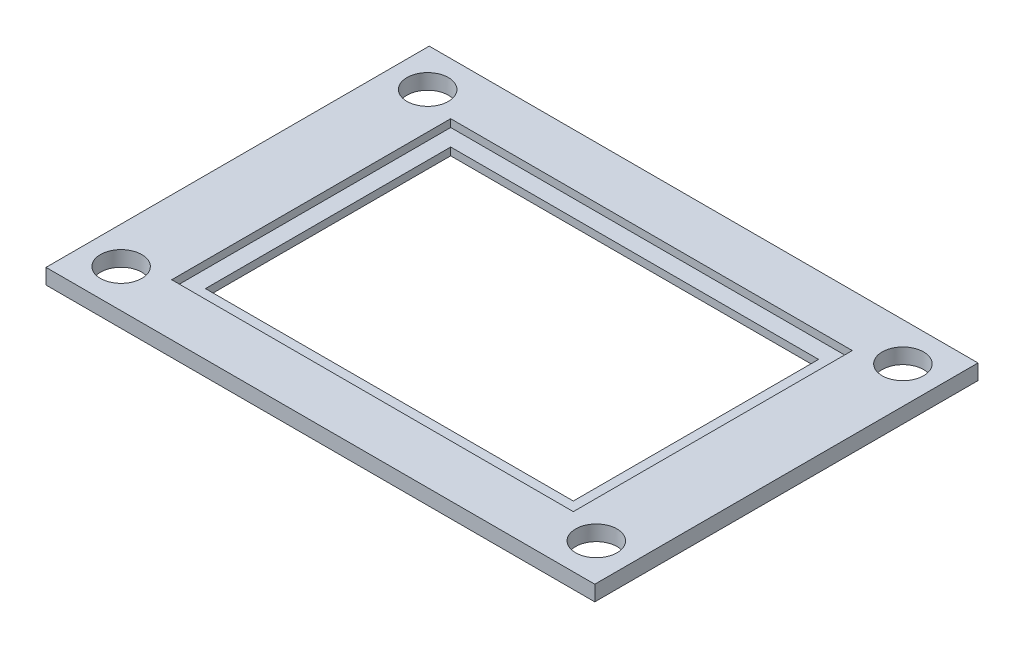
ISO-10303-21;
HEADER;
FILE_DESCRIPTION(('STEP AP214'),'2;1');
FILE_NAME('part.step','',(''),(''),'','','');
FILE_SCHEMA(('AUTOMOTIVE_DESIGN { 1 0 10303 214 1 1 1 1 }'));
ENDSEC;
DATA;
#1=APPLICATION_CONTEXT('core data for automotive mechanical design processes');
#2=APPLICATION_PROTOCOL_DEFINITION('international standard','automotive_design',2000,#1);
#3=PRODUCT_CONTEXT('',#1,'mechanical');
#4=PRODUCT('Part','Part','',(#3));
#5=PRODUCT_RELATED_PRODUCT_CATEGORY('part','',(#4));
#6=PRODUCT_DEFINITION_FORMATION('','',#4);
#7=PRODUCT_DEFINITION_CONTEXT('part definition',#1,'design');
#8=PRODUCT_DEFINITION('design','',#6,#7);
#9=PRODUCT_DEFINITION_SHAPE('','',#8);
#10=(LENGTH_UNIT() NAMED_UNIT(*) SI_UNIT(.MILLI.,.METRE.));
#11=(NAMED_UNIT(*) PLANE_ANGLE_UNIT() SI_UNIT($,.RADIAN.));
#12=(NAMED_UNIT(*) SI_UNIT($,.STERADIAN.) SOLID_ANGLE_UNIT());
#13=UNCERTAINTY_MEASURE_WITH_UNIT(LENGTH_MEASURE(1.E-05),#10,'distance_accuracy_value','');
#14=(GEOMETRIC_REPRESENTATION_CONTEXT(3) GLOBAL_UNCERTAINTY_ASSIGNED_CONTEXT((#13)) GLOBAL_UNIT_ASSIGNED_CONTEXT((#10,
#11,#12)) REPRESENTATION_CONTEXT('',''));
#15=CARTESIAN_POINT('',(0.,0.,0.));
#16=DIRECTION('',(0.,0.,1.));
#17=DIRECTION('',(1.,0.,0.));
#18=AXIS2_PLACEMENT_3D('',#15,#16,#17);
#19=CARTESIAN_POINT('',(0.,1.,0.));
#20=DIRECTION('',(0.,-1.,0.));
#21=DIRECTION('',(0.,0.,-1.));
#22=AXIS2_PLACEMENT_3D('',#19,#20,#21);
#23=PLANE('',#22);
#24=CARTESIAN_POINT('',(15.5,1.,-10.));
#25=DIRECTION('',(0.,1.,0.));
#26=DIRECTION('',(0.,0.,1.));
#27=AXIS2_PLACEMENT_3D('',#24,#25,#26);
#28=CIRCLE('',#27,1.35);
#29=CARTESIAN_POINT('',(15.5,1.,-8.65));
#30=VERTEX_POINT('',#29);
#31=EDGE_CURVE('E469',#30,#30,#28,.T.);
#32=ORIENTED_EDGE('',*,*,#31,.F.);
#33=EDGE_LOOP('',(#32));
#34=FACE_BOUND('',#33,.T.);
#35=CARTESIAN_POINT('',(15.5,1.,10.));
#36=DIRECTION('',(0.,1.,0.));
#37=DIRECTION('',(0.,0.,1.));
#38=AXIS2_PLACEMENT_3D('',#35,#36,#37);
#39=CIRCLE('',#38,1.35);
#40=CARTESIAN_POINT('',(15.5,1.,11.35));
#41=VERTEX_POINT('',#40);
#42=EDGE_CURVE('E476',#41,#41,#39,.T.);
#43=ORIENTED_EDGE('',*,*,#42,.F.);
#44=EDGE_LOOP('',(#43));
#45=FACE_BOUND('',#44,.T.);
#46=CARTESIAN_POINT('',(-15.5,1.,10.));
#47=DIRECTION('',(0.,1.,0.));
#48=DIRECTION('',(0.,0.,1.));
#49=AXIS2_PLACEMENT_3D('',#46,#47,#48);
#50=CIRCLE('',#49,1.35);
#51=CARTESIAN_POINT('',(-15.5,1.,11.35));
#52=VERTEX_POINT('',#51);
#53=EDGE_CURVE('E486',#52,#52,#50,.T.);
#54=ORIENTED_EDGE('',*,*,#53,.F.);
#55=EDGE_LOOP('',(#54));
#56=FACE_BOUND('',#55,.T.);
#57=CARTESIAN_POINT('',(-15.5,1.,-10.));
#58=DIRECTION('',(0.,1.,0.));
#59=DIRECTION('',(0.,0.,1.));
#60=AXIS2_PLACEMENT_3D('',#57,#58,#59);
#61=CIRCLE('',#60,1.35);
#62=CARTESIAN_POINT('',(-15.5,1.,-8.65));
#63=VERTEX_POINT('',#62);
#64=EDGE_CURVE('E167',#63,#63,#61,.T.);
#65=ORIENTED_EDGE('',*,*,#64,.F.);
#66=EDGE_LOOP('',(#65));
#67=FACE_BOUND('',#66,.T.);
#68=DIRECTION('',(-1.,0.,0.));
#69=VECTOR('',#68,1.);
#70=CARTESIAN_POINT('',(-13.1,1.,-9.1));
#71=LINE('',#70,#69);
#72=CARTESIAN_POINT('',(13.1,1.,-9.1));
#73=VERTEX_POINT('',#72);
#74=CARTESIAN_POINT('',(-13.1,1.,-9.1));
#75=VERTEX_POINT('',#74);
#76=EDGE_CURVE('E166',#73,#75,#71,.T.);
#77=ORIENTED_EDGE('',*,*,#76,.F.);
#78=DIRECTION('',(0.,0.,-1.));
#79=VECTOR('',#78,1.);
#80=CARTESIAN_POINT('',(13.1,1.,9.1));
#81=LINE('',#80,#79);
#82=CARTESIAN_POINT('',(13.1,1.,9.1));
#83=VERTEX_POINT('',#82);
#84=EDGE_CURVE('E54',#83,#73,#81,.T.);
#85=ORIENTED_EDGE('',*,*,#84,.F.);
#86=DIRECTION('',(1.,0.,0.));
#87=VECTOR('',#86,1.);
#88=CARTESIAN_POINT('',(-13.1,1.,9.1));
#89=LINE('',#88,#87);
#90=CARTESIAN_POINT('',(-13.1,1.,9.1));
#91=VERTEX_POINT('',#90);
#92=EDGE_CURVE('E150',#91,#83,#89,.T.);
#93=ORIENTED_EDGE('',*,*,#92,.F.);
#94=DIRECTION('',(0.,0.,1.));
#95=VECTOR('',#94,1.);
#96=CARTESIAN_POINT('',(-13.1,1.,9.1));
#97=LINE('',#96,#95);
#98=EDGE_CURVE('E154',#75,#91,#97,.T.);
#99=ORIENTED_EDGE('',*,*,#98,.F.);
#100=EDGE_LOOP('',(#77,#85,#93,#99));
#101=FACE_BOUND('',#100,.T.);
#102=DIRECTION('',(0.,0.,-1.));
#103=VECTOR('',#102,1.);
#104=CARTESIAN_POINT('',(17.9,1.,12.5));
#105=LINE('',#104,#103);
#106=CARTESIAN_POINT('',(17.9,1.,12.5));
#107=VERTEX_POINT('',#106);
#108=CARTESIAN_POINT('',(17.9,1.,-12.5));
#109=VERTEX_POINT('',#108);
#110=EDGE_CURVE('E218',#107,#109,#105,.T.);
#111=ORIENTED_EDGE('',*,*,#110,.T.);
#112=DIRECTION('',(-1.,0.,0.));
#113=VECTOR('',#112,1.);
#114=CARTESIAN_POINT('',(-17.9,1.,-12.5));
#115=LINE('',#114,#113);
#116=CARTESIAN_POINT('',(-17.9,1.,-12.5));
#117=VERTEX_POINT('',#116);
#118=EDGE_CURVE('E222',#109,#117,#115,.T.);
#119=ORIENTED_EDGE('',*,*,#118,.T.);
#120=DIRECTION('',(0.,0.,1.));
#121=VECTOR('',#120,1.);
#122=CARTESIAN_POINT('',(-17.9,1.,12.5));
#123=LINE('',#122,#121);
#124=CARTESIAN_POINT('',(-17.9,1.,12.5));
#125=VERTEX_POINT('',#124);
#126=EDGE_CURVE('E226',#117,#125,#123,.T.);
#127=ORIENTED_EDGE('',*,*,#126,.T.);
#128=DIRECTION('',(1.,0.,0.));
#129=VECTOR('',#128,1.);
#130=CARTESIAN_POINT('',(-17.9,1.,12.5));
#131=LINE('',#130,#129);
#132=EDGE_CURVE('E229',#125,#107,#131,.T.);
#133=ORIENTED_EDGE('',*,*,#132,.T.);
#134=EDGE_LOOP('',(#111,#119,#127,#133));
#135=FACE_BOUND('',#134,.T.);
#136=ADVANCED_FACE('F38',(#34,#45,#56,#67,#101,#135),#23,.F.);
#137=CARTESIAN_POINT('',(0.,0.,0.));
#138=DIRECTION('',(0.,-1.,0.));
#139=DIRECTION('',(0.,0.,-1.));
#140=AXIS2_PLACEMENT_3D('',#137,#138,#139);
#141=PLANE('',#140);
#142=CARTESIAN_POINT('',(15.5,0.,-10.));
#143=DIRECTION('',(0.,-1.,0.));
#144=DIRECTION('',(0.,0.,-1.));
#145=AXIS2_PLACEMENT_3D('',#142,#143,#144);
#146=CIRCLE('',#145,1.35);
#147=CARTESIAN_POINT('',(15.5,0.,-11.35));
#148=VERTEX_POINT('',#147);
#149=EDGE_CURVE('E467',#148,#148,#146,.F.);
#150=ORIENTED_EDGE('',*,*,#149,.T.);
#151=EDGE_LOOP('',(#150));
#152=FACE_BOUND('',#151,.T.);
#153=CARTESIAN_POINT('',(15.5,0.,10.));
#154=DIRECTION('',(0.,-1.,0.));
#155=DIRECTION('',(0.,0.,-1.));
#156=AXIS2_PLACEMENT_3D('',#153,#154,#155);
#157=CIRCLE('',#156,1.35);
#158=CARTESIAN_POINT('',(15.5,0.,8.65));
#159=VERTEX_POINT('',#158);
#160=EDGE_CURVE('E471',#159,#159,#157,.F.);
#161=ORIENTED_EDGE('',*,*,#160,.T.);
#162=EDGE_LOOP('',(#161));
#163=FACE_BOUND('',#162,.T.);
#164=CARTESIAN_POINT('',(-15.5,0.,10.));
#165=DIRECTION('',(0.,-1.,0.));
#166=DIRECTION('',(0.,0.,-1.));
#167=AXIS2_PLACEMENT_3D('',#164,#165,#166);
#168=CIRCLE('',#167,1.35);
#169=CARTESIAN_POINT('',(-15.5,0.,8.65));
#170=VERTEX_POINT('',#169);
#171=EDGE_CURVE('E491',#170,#170,#168,.F.);
#172=ORIENTED_EDGE('',*,*,#171,.T.);
#173=EDGE_LOOP('',(#172));
#174=FACE_BOUND('',#173,.T.);
#175=CARTESIAN_POINT('',(-15.5,0.,-10.));
#176=DIRECTION('',(0.,-1.,0.));
#177=DIRECTION('',(0.,0.,-1.));
#178=AXIS2_PLACEMENT_3D('',#175,#176,#177);
#179=CIRCLE('',#178,1.35);
#180=CARTESIAN_POINT('',(-15.5,0.,-11.35));
#181=VERTEX_POINT('',#180);
#182=EDGE_CURVE('E157',#181,#181,#179,.F.);
#183=ORIENTED_EDGE('',*,*,#182,.T.);
#184=EDGE_LOOP('',(#183));
#185=FACE_BOUND('',#184,.T.);
#186=DIRECTION('',(0.,0.,-1.));
#187=VECTOR('',#186,1.);
#188=CARTESIAN_POINT('',(17.9,0.,12.5));
#189=LINE('',#188,#187);
#190=CARTESIAN_POINT('',(17.9,0.,12.5));
#191=VERTEX_POINT('',#190);
#192=CARTESIAN_POINT('',(17.9,0.,-12.5));
#193=VERTEX_POINT('',#192);
#194=EDGE_CURVE('E217',#191,#193,#189,.T.);
#195=ORIENTED_EDGE('',*,*,#194,.F.);
#196=DIRECTION('',(1.,0.,0.));
#197=VECTOR('',#196,1.);
#198=CARTESIAN_POINT('',(-17.9,0.,12.5));
#199=LINE('',#198,#197);
#200=CARTESIAN_POINT('',(-17.9,0.,12.5));
#201=VERTEX_POINT('',#200);
#202=EDGE_CURVE('E223',#201,#191,#199,.T.);
#203=ORIENTED_EDGE('',*,*,#202,.F.);
#204=DIRECTION('',(0.,0.,1.));
#205=VECTOR('',#204,1.);
#206=CARTESIAN_POINT('',(-17.9,0.,12.5));
#207=LINE('',#206,#205);
#208=CARTESIAN_POINT('',(-17.9,0.,-12.5));
#209=VERTEX_POINT('',#208);
#210=EDGE_CURVE('E239',#209,#201,#207,.T.);
#211=ORIENTED_EDGE('',*,*,#210,.F.);
#212=DIRECTION('',(-1.,0.,0.));
#213=VECTOR('',#212,1.);
#214=CARTESIAN_POINT('',(-17.9,0.,-12.5));
#215=LINE('',#214,#213);
#216=EDGE_CURVE('E236',#193,#209,#215,.T.);
#217=ORIENTED_EDGE('',*,*,#216,.F.);
#218=EDGE_LOOP('',(#195,#203,#211,#217));
#219=FACE_BOUND('',#218,.T.);
#220=DIRECTION('',(1.,0.,0.));
#221=VECTOR('',#220,1.);
#222=CARTESIAN_POINT('',(-12.,0.,8.));
#223=LINE('',#222,#221);
#224=CARTESIAN_POINT('',(-12.,0.,8.));
#225=VERTEX_POINT('',#224);
#226=CARTESIAN_POINT('',(12.,0.,8.));
#227=VERTEX_POINT('',#226);
#228=EDGE_CURVE('E201',#225,#227,#223,.T.);
#229=ORIENTED_EDGE('',*,*,#228,.T.);
#230=DIRECTION('',(0.,0.,-1.));
#231=VECTOR('',#230,1.);
#232=CARTESIAN_POINT('',(12.,0.,8.));
#233=LINE('',#232,#231);
#234=CARTESIAN_POINT('',(12.,0.,-8.));
#235=VERTEX_POINT('',#234);
#236=EDGE_CURVE('E189',#227,#235,#233,.T.);
#237=ORIENTED_EDGE('',*,*,#236,.T.);
#238=DIRECTION('',(-1.,0.,0.));
#239=VECTOR('',#238,1.);
#240=CARTESIAN_POINT('',(-12.,0.,-8.));
#241=LINE('',#240,#239);
#242=CARTESIAN_POINT('',(-12.,0.,-8.));
#243=VERTEX_POINT('',#242);
#244=EDGE_CURVE('E193',#235,#243,#241,.T.);
#245=ORIENTED_EDGE('',*,*,#244,.T.);
#246=DIRECTION('',(0.,0.,1.));
#247=VECTOR('',#246,1.);
#248=CARTESIAN_POINT('',(-12.,0.,8.));
#249=LINE('',#248,#247);
#250=EDGE_CURVE('E197',#243,#225,#249,.T.);
#251=ORIENTED_EDGE('',*,*,#250,.T.);
#252=EDGE_LOOP('',(#229,#237,#245,#251));
#253=FACE_BOUND('',#252,.T.);
#254=ADVANCED_FACE('F266',(#152,#163,#174,#185,#219,#253),#141,.T.);
#255=CARTESIAN_POINT('',(17.9,1.,12.5));
#256=DIRECTION('',(-1.,0.,0.));
#257=DIRECTION('',(0.,0.,1.));
#258=AXIS2_PLACEMENT_3D('',#255,#256,#257);
#259=PLANE('',#258);
#260=ORIENTED_EDGE('',*,*,#194,.T.);
#261=DIRECTION('',(0.,-1.,0.));
#262=VECTOR('',#261,1.);
#263=CARTESIAN_POINT('',(17.9,1.,-12.5));
#264=LINE('',#263,#262);
#265=EDGE_CURVE('E47',#109,#193,#264,.T.);
#266=ORIENTED_EDGE('',*,*,#265,.F.);
#267=ORIENTED_EDGE('',*,*,#110,.F.);
#268=DIRECTION('',(0.,-1.,0.));
#269=VECTOR('',#268,1.);
#270=CARTESIAN_POINT('',(17.9,1.,12.5));
#271=LINE('',#270,#269);
#272=EDGE_CURVE('E232',#107,#191,#271,.T.);
#273=ORIENTED_EDGE('',*,*,#272,.T.);
#274=EDGE_LOOP('',(#260,#266,#267,#273));
#275=FACE_BOUND('',#274,.T.);
#276=ADVANCED_FACE('F40',(#275),#259,.F.);
#277=CARTESIAN_POINT('',(-17.9,1.,-12.5));
#278=DIRECTION('',(0.,0.,1.));
#279=DIRECTION('',(1.,0.,0.));
#280=AXIS2_PLACEMENT_3D('',#277,#278,#279);
#281=PLANE('',#280);
#282=ORIENTED_EDGE('',*,*,#216,.T.);
#283=DIRECTION('',(0.,-1.,0.));
#284=VECTOR('',#283,1.);
#285=CARTESIAN_POINT('',(-17.9,1.,-12.5));
#286=LINE('',#285,#284);
#287=EDGE_CURVE('E251',#117,#209,#286,.T.);
#288=ORIENTED_EDGE('',*,*,#287,.F.);
#289=ORIENTED_EDGE('',*,*,#118,.F.);
#290=ORIENTED_EDGE('',*,*,#265,.T.);
#291=EDGE_LOOP('',(#282,#288,#289,#290));
#292=FACE_BOUND('',#291,.T.);
#293=ADVANCED_FACE('F258',(#292),#281,.F.);
#294=CARTESIAN_POINT('',(-17.9,1.,12.5));
#295=DIRECTION('',(1.,0.,0.));
#296=DIRECTION('',(0.,0.,-1.));
#297=AXIS2_PLACEMENT_3D('',#294,#295,#296);
#298=PLANE('',#297);
#299=ORIENTED_EDGE('',*,*,#210,.T.);
#300=DIRECTION('',(0.,-1.,0.));
#301=VECTOR('',#300,1.);
#302=CARTESIAN_POINT('',(-17.9,1.,12.5));
#303=LINE('',#302,#301);
#304=EDGE_CURVE('E247',#125,#201,#303,.T.);
#305=ORIENTED_EDGE('',*,*,#304,.F.);
#306=ORIENTED_EDGE('',*,*,#126,.F.);
#307=ORIENTED_EDGE('',*,*,#287,.T.);
#308=EDGE_LOOP('',(#299,#305,#306,#307));
#309=FACE_BOUND('',#308,.T.);
#310=ADVANCED_FACE('F271',(#309),#298,.F.);
#311=CARTESIAN_POINT('',(-17.9,1.,12.5));
#312=DIRECTION('',(0.,0.,-1.));
#313=DIRECTION('',(-1.,0.,0.));
#314=AXIS2_PLACEMENT_3D('',#311,#312,#313);
#315=PLANE('',#314);
#316=ORIENTED_EDGE('',*,*,#202,.T.);
#317=ORIENTED_EDGE('',*,*,#272,.F.);
#318=ORIENTED_EDGE('',*,*,#132,.F.);
#319=ORIENTED_EDGE('',*,*,#304,.T.);
#320=EDGE_LOOP('',(#316,#317,#318,#319));
#321=FACE_BOUND('',#320,.T.);
#322=ADVANCED_FACE('F275',(#321),#315,.F.);
#323=CARTESIAN_POINT('',(12.,1.,8.));
#324=DIRECTION('',(-1.,0.,0.));
#325=DIRECTION('',(0.,0.,1.));
#326=AXIS2_PLACEMENT_3D('',#323,#324,#325);
#327=PLANE('',#326);
#328=DIRECTION('',(0.,0.,1.));
#329=VECTOR('',#328,1.);
#330=CARTESIAN_POINT('',(12.,0.5,8.));
#331=LINE('',#330,#329);
#332=CARTESIAN_POINT('',(12.,0.5,-8.));
#333=VERTEX_POINT('',#332);
#334=CARTESIAN_POINT('',(12.,0.5,8.));
#335=VERTEX_POINT('',#334);
#336=EDGE_CURVE('E61',#333,#335,#331,.T.);
#337=ORIENTED_EDGE('',*,*,#336,.F.);
#338=DIRECTION('',(0.,-1.,0.));
#339=VECTOR('',#338,1.);
#340=CARTESIAN_POINT('',(12.,1.,-8.));
#341=LINE('',#340,#339);
#342=EDGE_CURVE('E214',#333,#235,#341,.T.);
#343=ORIENTED_EDGE('',*,*,#342,.T.);
#344=ORIENTED_EDGE('',*,*,#236,.F.);
#345=DIRECTION('',(0.,-1.,0.));
#346=VECTOR('',#345,1.);
#347=CARTESIAN_POINT('',(12.,1.,8.));
#348=LINE('',#347,#346);
#349=EDGE_CURVE('E205',#335,#227,#348,.T.);
#350=ORIENTED_EDGE('',*,*,#349,.F.);
#351=EDGE_LOOP('',(#337,#343,#344,#350));
#352=FACE_BOUND('',#351,.T.);
#353=ADVANCED_FACE('F289',(#352),#327,.T.);
#354=CARTESIAN_POINT('',(-12.,1.,-8.));
#355=DIRECTION('',(0.,0.,1.));
#356=DIRECTION('',(1.,0.,0.));
#357=AXIS2_PLACEMENT_3D('',#354,#355,#356);
#358=PLANE('',#357);
#359=DIRECTION('',(1.,0.,0.));
#360=VECTOR('',#359,1.);
#361=CARTESIAN_POINT('',(-12.,0.5,-8.));
#362=LINE('',#361,#360);
#363=CARTESIAN_POINT('',(-12.,0.5,-8.));
#364=VERTEX_POINT('',#363);
#365=EDGE_CURVE('E184',#364,#333,#362,.T.);
#366=ORIENTED_EDGE('',*,*,#365,.F.);
#367=DIRECTION('',(0.,-1.,0.));
#368=VECTOR('',#367,1.);
#369=CARTESIAN_POINT('',(-12.,1.,-8.));
#370=LINE('',#369,#368);
#371=EDGE_CURVE('E211',#364,#243,#370,.T.);
#372=ORIENTED_EDGE('',*,*,#371,.T.);
#373=ORIENTED_EDGE('',*,*,#244,.F.);
#374=ORIENTED_EDGE('',*,*,#342,.F.);
#375=EDGE_LOOP('',(#366,#372,#373,#374));
#376=FACE_BOUND('',#375,.T.);
#377=ADVANCED_FACE('F377',(#376),#358,.T.);
#378=CARTESIAN_POINT('',(-12.,1.,8.));
#379=DIRECTION('',(1.,0.,0.));
#380=DIRECTION('',(0.,0.,-1.));
#381=AXIS2_PLACEMENT_3D('',#378,#379,#380);
#382=PLANE('',#381);
#383=DIRECTION('',(0.,0.,-1.));
#384=VECTOR('',#383,1.);
#385=CARTESIAN_POINT('',(-12.,0.5,8.));
#386=LINE('',#385,#384);
#387=CARTESIAN_POINT('',(-12.,0.5,8.));
#388=VERTEX_POINT('',#387);
#389=EDGE_CURVE('E176',#388,#364,#386,.T.);
#390=ORIENTED_EDGE('',*,*,#389,.F.);
#391=DIRECTION('',(0.,-1.,0.));
#392=VECTOR('',#391,1.);
#393=CARTESIAN_POINT('',(-12.,1.,8.));
#394=LINE('',#393,#392);
#395=EDGE_CURVE('E208',#388,#225,#394,.T.);
#396=ORIENTED_EDGE('',*,*,#395,.T.);
#397=ORIENTED_EDGE('',*,*,#250,.F.);
#398=ORIENTED_EDGE('',*,*,#371,.F.);
#399=EDGE_LOOP('',(#390,#396,#397,#398));
#400=FACE_BOUND('',#399,.T.);
#401=ADVANCED_FACE('F374',(#400),#382,.T.);
#402=CARTESIAN_POINT('',(-12.,1.,8.));
#403=DIRECTION('',(0.,0.,-1.));
#404=DIRECTION('',(-1.,0.,0.));
#405=AXIS2_PLACEMENT_3D('',#402,#403,#404);
#406=PLANE('',#405);
#407=DIRECTION('',(-1.,0.,0.));
#408=VECTOR('',#407,1.);
#409=CARTESIAN_POINT('',(-12.,0.5,8.));
#410=LINE('',#409,#408);
#411=EDGE_CURVE('E11',#335,#388,#410,.T.);
#412=ORIENTED_EDGE('',*,*,#411,.F.);
#413=ORIENTED_EDGE('',*,*,#349,.T.);
#414=ORIENTED_EDGE('',*,*,#228,.F.);
#415=ORIENTED_EDGE('',*,*,#395,.F.);
#416=EDGE_LOOP('',(#412,#413,#414,#415));
#417=FACE_BOUND('',#416,.T.);
#418=ADVANCED_FACE('F371',(#417),#406,.T.);
#419=CARTESIAN_POINT('',(13.1,0.5,9.1));
#420=DIRECTION('',(1.,0.,0.));
#421=DIRECTION('',(0.,0.,-1.));
#422=AXIS2_PLACEMENT_3D('',#419,#420,#421);
#423=PLANE('',#422);
#424=ORIENTED_EDGE('',*,*,#84,.T.);
#425=DIRECTION('',(0.,1.,0.));
#426=VECTOR('',#425,1.);
#427=CARTESIAN_POINT('',(13.1,0.5,-9.1));
#428=LINE('',#427,#426);
#429=CARTESIAN_POINT('',(13.1,0.5,-9.1));
#430=VERTEX_POINT('',#429);
#431=EDGE_CURVE('E125',#430,#73,#428,.T.);
#432=ORIENTED_EDGE('',*,*,#431,.F.);
#433=DIRECTION('',(0.,0.,-1.));
#434=VECTOR('',#433,1.);
#435=CARTESIAN_POINT('',(13.1,0.5,9.1));
#436=LINE('',#435,#434);
#437=CARTESIAN_POINT('',(13.1,0.5,9.1));
#438=VERTEX_POINT('',#437);
#439=EDGE_CURVE('E129',#438,#430,#436,.T.);
#440=ORIENTED_EDGE('',*,*,#439,.F.);
#441=DIRECTION('',(0.,1.,0.));
#442=VECTOR('',#441,1.);
#443=CARTESIAN_POINT('',(13.1,0.5,9.1));
#444=LINE('',#443,#442);
#445=EDGE_CURVE('E173',#438,#83,#444,.T.);
#446=ORIENTED_EDGE('',*,*,#445,.T.);
#447=EDGE_LOOP('',(#424,#432,#440,#446));
#448=FACE_BOUND('',#447,.T.);
#449=ADVANCED_FACE('F127',(#448),#423,.F.);
#450=CARTESIAN_POINT('',(-13.1,0.5,9.1));
#451=DIRECTION('',(0.,0.,1.));
#452=DIRECTION('',(1.,0.,0.));
#453=AXIS2_PLACEMENT_3D('',#450,#451,#452);
#454=PLANE('',#453);
#455=ORIENTED_EDGE('',*,*,#92,.T.);
#456=ORIENTED_EDGE('',*,*,#445,.F.);
#457=DIRECTION('',(1.,0.,0.));
#458=VECTOR('',#457,1.);
#459=CARTESIAN_POINT('',(-13.1,0.5,9.1));
#460=LINE('',#459,#458);
#461=CARTESIAN_POINT('',(-13.1,0.5,9.1));
#462=VERTEX_POINT('',#461);
#463=EDGE_CURVE('E136',#462,#438,#460,.T.);
#464=ORIENTED_EDGE('',*,*,#463,.F.);
#465=DIRECTION('',(0.,1.,0.));
#466=VECTOR('',#465,1.);
#467=CARTESIAN_POINT('',(-13.1,0.5,9.1));
#468=LINE('',#467,#466);
#469=EDGE_CURVE('E177',#462,#91,#468,.T.);
#470=ORIENTED_EDGE('',*,*,#469,.T.);
#471=EDGE_LOOP('',(#455,#456,#464,#470));
#472=FACE_BOUND('',#471,.T.);
#473=ADVANCED_FACE('F359',(#472),#454,.F.);
#474=CARTESIAN_POINT('',(-13.1,0.5,9.1));
#475=DIRECTION('',(-1.,0.,0.));
#476=DIRECTION('',(0.,0.,1.));
#477=AXIS2_PLACEMENT_3D('',#474,#475,#476);
#478=PLANE('',#477);
#479=ORIENTED_EDGE('',*,*,#98,.T.);
#480=ORIENTED_EDGE('',*,*,#469,.F.);
#481=DIRECTION('',(0.,0.,1.));
#482=VECTOR('',#481,1.);
#483=CARTESIAN_POINT('',(-13.1,0.5,9.1));
#484=LINE('',#483,#482);
#485=CARTESIAN_POINT('',(-13.1,0.5,-9.1));
#486=VERTEX_POINT('',#485);
#487=EDGE_CURVE('E145',#486,#462,#484,.T.);
#488=ORIENTED_EDGE('',*,*,#487,.F.);
#489=DIRECTION('',(0.,1.,0.));
#490=VECTOR('',#489,1.);
#491=CARTESIAN_POINT('',(-13.1,0.5,-9.1));
#492=LINE('',#491,#490);
#493=EDGE_CURVE('E135',#486,#75,#492,.T.);
#494=ORIENTED_EDGE('',*,*,#493,.T.);
#495=EDGE_LOOP('',(#479,#480,#488,#494));
#496=FACE_BOUND('',#495,.T.);
#497=ADVANCED_FACE('F362',(#496),#478,.F.);
#498=CARTESIAN_POINT('',(-13.1,0.5,-9.1));
#499=DIRECTION('',(0.,0.,-1.));
#500=DIRECTION('',(-1.,0.,0.));
#501=AXIS2_PLACEMENT_3D('',#498,#499,#500);
#502=PLANE('',#501);
#503=ORIENTED_EDGE('',*,*,#76,.T.);
#504=ORIENTED_EDGE('',*,*,#493,.F.);
#505=DIRECTION('',(-1.,0.,0.));
#506=VECTOR('',#505,1.);
#507=CARTESIAN_POINT('',(-13.1,0.5,-9.1));
#508=LINE('',#507,#506);
#509=EDGE_CURVE('E139',#430,#486,#508,.T.);
#510=ORIENTED_EDGE('',*,*,#509,.F.);
#511=ORIENTED_EDGE('',*,*,#431,.T.);
#512=EDGE_LOOP('',(#503,#504,#510,#511));
#513=FACE_BOUND('',#512,.T.);
#514=ADVANCED_FACE('F140',(#513),#502,.F.);
#515=CARTESIAN_POINT('',(0.,0.5,0.));
#516=DIRECTION('',(0.,-1.,0.));
#517=DIRECTION('',(0.,0.,-1.));
#518=AXIS2_PLACEMENT_3D('',#515,#516,#517);
#519=PLANE('',#518);
#520=ORIENTED_EDGE('',*,*,#336,.T.);
#521=ORIENTED_EDGE('',*,*,#411,.T.);
#522=ORIENTED_EDGE('',*,*,#389,.T.);
#523=ORIENTED_EDGE('',*,*,#365,.T.);
#524=EDGE_LOOP('',(#520,#521,#522,#523));
#525=FACE_BOUND('',#524,.T.);
#526=ORIENTED_EDGE('',*,*,#439,.T.);
#527=ORIENTED_EDGE('',*,*,#509,.T.);
#528=ORIENTED_EDGE('',*,*,#487,.T.);
#529=ORIENTED_EDGE('',*,*,#463,.T.);
#530=EDGE_LOOP('',(#526,#527,#528,#529));
#531=FACE_BOUND('',#530,.T.);
#532=ADVANCED_FACE('F147',(#525,#531),#519,.F.);
#533=CARTESIAN_POINT('',(-15.5,-0.000999999999999916,-10.));
#534=DIRECTION('',(0.,1.,0.));
#535=DIRECTION('',(0.,0.,1.));
#536=AXIS2_PLACEMENT_3D('',#533,#534,#535);
#537=CYLINDRICAL_SURFACE('',#536,1.35);
#538=ORIENTED_EDGE('',*,*,#182,.F.);
#539=EDGE_LOOP('',(#538));
#540=FACE_BOUND('',#539,.T.);
#541=ORIENTED_EDGE('',*,*,#64,.T.);
#542=EDGE_LOOP('',(#541));
#543=FACE_BOUND('',#542,.T.);
#544=ADVANCED_FACE('F314',(#540,#543),#537,.F.);
#545=CARTESIAN_POINT('',(-15.5,-0.000999999999999916,10.));
#546=DIRECTION('',(0.,1.,0.));
#547=DIRECTION('',(0.,0.,1.));
#548=AXIS2_PLACEMENT_3D('',#545,#546,#547);
#549=CYLINDRICAL_SURFACE('',#548,1.35);
#550=ORIENTED_EDGE('',*,*,#171,.F.);
#551=EDGE_LOOP('',(#550));
#552=FACE_BOUND('',#551,.T.);
#553=ORIENTED_EDGE('',*,*,#53,.T.);
#554=EDGE_LOOP('',(#553));
#555=FACE_BOUND('',#554,.T.);
#556=ADVANCED_FACE('F319',(#552,#555),#549,.F.);
#557=CARTESIAN_POINT('',(15.5,-0.000999999999999916,10.));
#558=DIRECTION('',(0.,1.,0.));
#559=DIRECTION('',(0.,0.,1.));
#560=AXIS2_PLACEMENT_3D('',#557,#558,#559);
#561=CYLINDRICAL_SURFACE('',#560,1.35);
#562=ORIENTED_EDGE('',*,*,#160,.F.);
#563=EDGE_LOOP('',(#562));
#564=FACE_BOUND('',#563,.T.);
#565=ORIENTED_EDGE('',*,*,#42,.T.);
#566=EDGE_LOOP('',(#565));
#567=FACE_BOUND('',#566,.T.);
#568=ADVANCED_FACE('F331',(#564,#567),#561,.F.);
#569=CARTESIAN_POINT('',(15.5,-0.000999999999999916,-10.));
#570=DIRECTION('',(0.,1.,0.));
#571=DIRECTION('',(0.,0.,1.));
#572=AXIS2_PLACEMENT_3D('',#569,#570,#571);
#573=CYLINDRICAL_SURFACE('',#572,1.35);
#574=ORIENTED_EDGE('',*,*,#149,.F.);
#575=EDGE_LOOP('',(#574));
#576=FACE_BOUND('',#575,.T.);
#577=ORIENTED_EDGE('',*,*,#31,.T.);
#578=EDGE_LOOP('',(#577));
#579=FACE_BOUND('',#578,.T.);
#580=ADVANCED_FACE('F341',(#576,#579),#573,.F.);
#581=CLOSED_SHELL('',(#136,#254,#276,#293,#310,#322,#353,#377,#401,#418,#449,#473,#497,#514,
#532,#544,#556,#568,#580));
#582=MANIFOLD_SOLID_BREP('B2',#581);
#583=ADVANCED_BREP_SHAPE_REPRESENTATION('',(#18,#582),#14);
#584=SHAPE_DEFINITION_REPRESENTATION(#9,#583);
ENDSEC;
END-ISO-10303-21;
